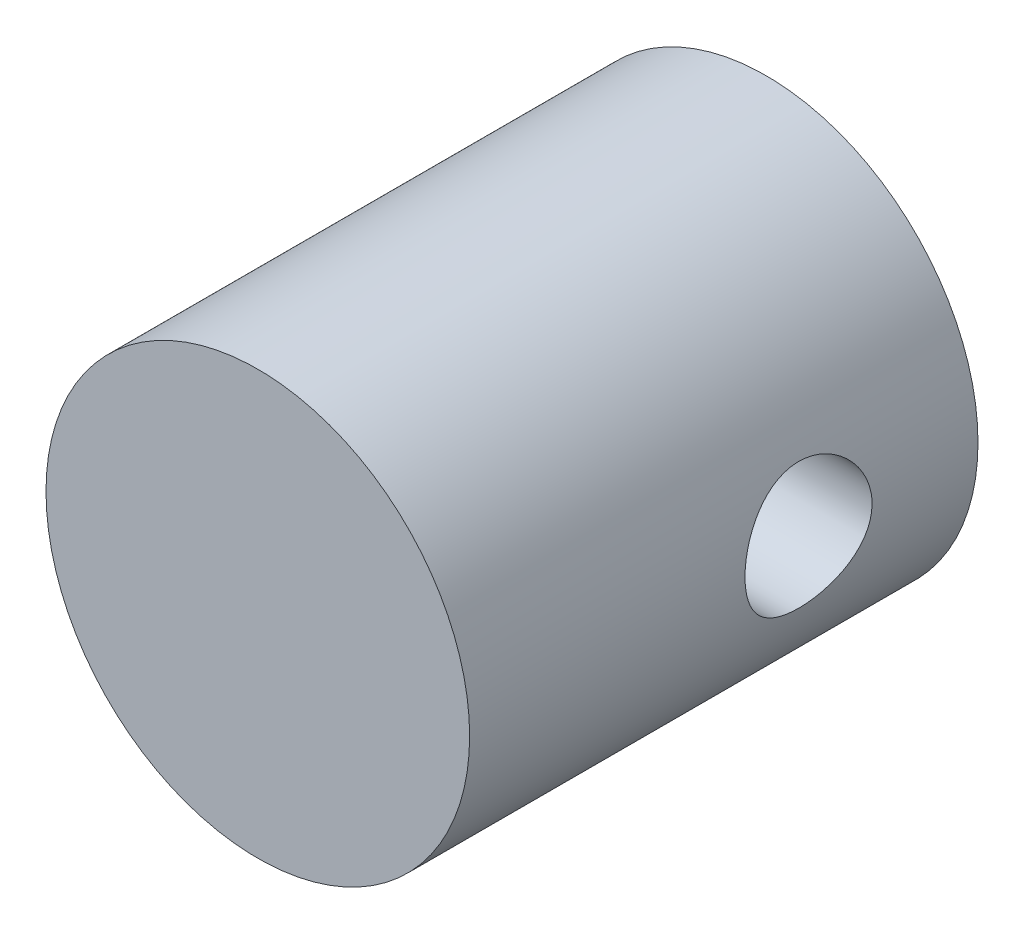
ISO-10303-21;
HEADER;
FILE_DESCRIPTION(('STEP AP214'),'2;1');
FILE_NAME('part.step','',(''),(''),'','','');
FILE_SCHEMA(('AUTOMOTIVE_DESIGN { 1 0 10303 214 1 1 1 1 }'));
ENDSEC;
DATA;
#1=APPLICATION_CONTEXT('core data for automotive mechanical design processes');
#2=APPLICATION_PROTOCOL_DEFINITION('international standard','automotive_design',2000,#1);
#3=PRODUCT_CONTEXT('',#1,'mechanical');
#4=PRODUCT('Part','Part','',(#3));
#5=PRODUCT_RELATED_PRODUCT_CATEGORY('part','',(#4));
#6=PRODUCT_DEFINITION_FORMATION('','',#4);
#7=PRODUCT_DEFINITION_CONTEXT('part definition',#1,'design');
#8=PRODUCT_DEFINITION('design','',#6,#7);
#9=PRODUCT_DEFINITION_SHAPE('','',#8);
#10=(LENGTH_UNIT() NAMED_UNIT(*) SI_UNIT(.MILLI.,.METRE.));
#11=(NAMED_UNIT(*) PLANE_ANGLE_UNIT() SI_UNIT($,.RADIAN.));
#12=(NAMED_UNIT(*) SI_UNIT($,.STERADIAN.) SOLID_ANGLE_UNIT());
#13=UNCERTAINTY_MEASURE_WITH_UNIT(LENGTH_MEASURE(1.E-05),#10,'distance_accuracy_value','');
#14=(GEOMETRIC_REPRESENTATION_CONTEXT(3) GLOBAL_UNCERTAINTY_ASSIGNED_CONTEXT((#13)) GLOBAL_UNIT_ASSIGNED_CONTEXT((#10,
#11,#12)) REPRESENTATION_CONTEXT('',''));
#15=CARTESIAN_POINT('',(0.,0.,0.));
#16=DIRECTION('',(0.,0.,1.));
#17=DIRECTION('',(1.,0.,0.));
#18=AXIS2_PLACEMENT_3D('',#15,#16,#17);
#19=CARTESIAN_POINT('',(0.,0.,6.));
#20=DIRECTION('',(0.,0.,-1.));
#21=DIRECTION('',(-1.,0.,0.));
#22=AXIS2_PLACEMENT_3D('',#19,#20,#21);
#23=CYLINDRICAL_SURFACE('',#22,2.5);
#24=CARTESIAN_POINT('',(-2.5,0.,1.25));
#25=CARTESIAN_POINT('',(-2.49999964625276,0.04114430637665,1.25000049874244));
#26=CARTESIAN_POINT('',(-2.49897457846979,0.0822936591757648,1.25339693181198));
#27=CARTESIAN_POINT('',(-2.49498552796844,0.16339406265244,1.26686067711105));
#28=CARTESIAN_POINT('',(-2.49202096694839,0.20334475220571,1.27692997901167));
#29=CARTESIAN_POINT('',(-2.48447776250925,0.280866353877264,1.30337300845513));
#30=CARTESIAN_POINT('',(-2.47990150125239,0.318440682197688,1.31973743480948));
#31=CARTESIAN_POINT('',(-2.46961054618796,0.390312090526564,1.35826804652791));
#32=CARTESIAN_POINT('',(-2.46389570095935,0.42460873373483,1.38043500369767));
#33=CARTESIAN_POINT('',(-2.45175368596488,0.489935898591878,1.43061200373637));
#34=CARTESIAN_POINT('',(-2.445311918289,0.52085903562219,1.4587583129431));
#35=CARTESIAN_POINT('',(-2.43252917104839,0.577624604616599,1.51980461495495));
#36=CARTESIAN_POINT('',(-2.42618820860824,0.603466181637131,1.55270540606195));
#37=CARTESIAN_POINT('',(-2.41417056998345,0.649900188618613,1.62323537651934));
#38=CARTESIAN_POINT('',(-2.4085120333744,0.67036154511135,1.6609542304974));
#39=CARTESIAN_POINT('',(-2.39871810191514,0.704606973873519,1.73949462711312));
#40=CARTESIAN_POINT('',(-2.39458234136111,0.71839264959881,1.78031542195642));
#41=CARTESIAN_POINT('',(-2.38845435439231,0.738508168412816,1.86269513306657));
#42=CARTESIAN_POINT('',(-2.38640534735889,0.745035981175235,1.90420137194677));
#43=CARTESIAN_POINT('',(-2.38451394948142,0.751068653075397,1.98776657812637));
#44=CARTESIAN_POINT('',(-2.38467102399599,0.750575213805359,2.02982540903726));
#45=CARTESIAN_POINT('',(-2.38712372015292,0.742734885998503,2.11169195430293));
#46=CARTESIAN_POINT('',(-2.38934194294585,0.735636026313277,2.15152612518077));
#47=CARTESIAN_POINT('',(-2.39554178119298,0.715187102135428,2.22940989313708));
#48=CARTESIAN_POINT('',(-2.3995235706752,0.701836420708245,2.26745931368726));
#49=CARTESIAN_POINT('',(-2.40886366536124,0.669080133268368,2.34130017483027));
#50=CARTESIAN_POINT('',(-2.4142400805761,0.649594084673201,2.37705354197761));
#51=CARTESIAN_POINT('',(-2.42575493500398,0.605176112943428,2.44486601100512));
#52=CARTESIAN_POINT('',(-2.43189355873596,0.580242870012945,2.4769242147069));
#53=CARTESIAN_POINT('',(-2.44455505648865,0.524406453827728,2.537843095381));
#54=CARTESIAN_POINT('',(-2.45108327155221,0.493297453733485,2.56651433201483));
#55=CARTESIAN_POINT('',(-2.46356122031657,0.426631629656984,2.61827699203213));
#56=CARTESIAN_POINT('',(-2.46951091759213,0.391074525930444,2.64136806420721));
#57=CARTESIAN_POINT('',(-2.48021580034728,0.316177519171401,2.68142996123237));
#58=CARTESIAN_POINT('',(-2.48496271834155,0.276813874873975,2.69835875812493));
#59=CARTESIAN_POINT('',(-2.49266760916113,0.19562270780176,2.72529979504982));
#60=CARTESIAN_POINT('',(-2.495626080935,0.153795875794791,2.73531396426625));
#61=CARTESIAN_POINT('',(-2.49934182321769,0.0704761213341656,2.7478260889497));
#62=CARTESIAN_POINT('',(-2.50017425208897,0.029025048800593,2.7505807929008));
#63=CARTESIAN_POINT('',(-2.49976461620879,-0.0537498029116912,2.74921542214396));
#64=CARTESIAN_POINT('',(-2.49852282838873,-0.095073598345389,2.74509626517428));
#65=CARTESIAN_POINT('',(-2.49415348493587,-0.17545180265485,2.73030769444425));
#66=CARTESIAN_POINT('',(-2.49106914899727,-0.214536386307091,2.71978830620955));
#67=CARTESIAN_POINT('',(-2.48337173920748,-0.290377319477256,2.69267838361091));
#68=CARTESIAN_POINT('',(-2.47875848160472,-0.327133388512772,2.67608711948112));
#69=CARTESIAN_POINT('',(-2.46834827175735,-0.398218594730548,2.63687341725938));
#70=CARTESIAN_POINT('',(-2.4625264041511,-0.432471913099915,2.6141203295258));
#71=CARTESIAN_POINT('',(-2.45036734381886,-0.496761653989995,2.5633876229738));
#72=CARTESIAN_POINT('',(-2.44403002214522,-0.526797016177672,2.53540669405695));
#73=CARTESIAN_POINT('',(-2.43126585935624,-0.582928722755441,2.47380634581452));
#74=CARTESIAN_POINT('',(-2.42484412520639,-0.608842406158679,2.44001906211106));
#75=CARTESIAN_POINT('',(-2.41288257615227,-0.654644975359607,2.36843603049631));
#76=CARTESIAN_POINT('',(-2.40734273812361,-0.674534019143021,2.33064038773239));
#77=CARTESIAN_POINT('',(-2.39783594822466,-0.707586735638617,2.25223375436488));
#78=CARTESIAN_POINT('',(-2.39386168977456,-0.720781734698862,2.21163690669671));
#79=CARTESIAN_POINT('',(-2.38795797236724,-0.740108654089556,2.12865601549723));
#80=CARTESIAN_POINT('',(-2.38602781268684,-0.746242994897492,2.08627258959433));
#81=CARTESIAN_POINT('',(-2.38449986234108,-0.751109922422096,2.00281924081899));
#82=CARTESIAN_POINT('',(-2.38480823717645,-0.750140276541593,1.96176817449311));
#83=CARTESIAN_POINT('',(-2.3874970064788,-0.741537527224924,1.8804429483117));
#84=CARTESIAN_POINT('',(-2.3898773179727,-0.733904690623809,1.84016875741132));
#85=CARTESIAN_POINT('',(-2.39637881834211,-0.712384444020455,1.76202730042907));
#86=CARTESIAN_POINT('',(-2.40047802272719,-0.698575877535282,1.72413635631929));
#87=CARTESIAN_POINT('',(-2.40995139454832,-0.665157535605707,1.651178780591));
#88=CARTESIAN_POINT('',(-2.41532580597228,-0.645546649814398,1.61611269117958));
#89=CARTESIAN_POINT('',(-2.42698838212842,-0.600243819025343,1.54841844173648));
#90=CARTESIAN_POINT('',(-2.43330270081879,-0.574356380464964,1.5159256193698));
#91=CARTESIAN_POINT('',(-2.44600660225033,-0.517587173148914,1.45564875084606));
#92=CARTESIAN_POINT('',(-2.45239620411958,-0.486704108567251,1.42786593026612));
#93=CARTESIAN_POINT('',(-2.46475468285319,-0.419732881091622,1.37698829385249));
#94=CARTESIAN_POINT('',(-2.47070579882836,-0.383518942895303,1.35405427657226));
#95=CARTESIAN_POINT('',(-2.48130340227908,-0.307570686991764,1.31463241504799));
#96=CARTESIAN_POINT('',(-2.48595049965534,-0.267838026499477,1.29814155586275));
#97=CARTESIAN_POINT('',(-2.4930108748465,-0.19037885632764,1.27355236217362));
#98=CARTESIAN_POINT('',(-2.49561013690534,-0.152893480977116,1.26474416355838));
#99=CARTESIAN_POINT('',(-2.49910472247246,-0.0769400976153893,1.25296823737921));
#100=CARTESIAN_POINT('',(-2.5000003307737,-0.0384722549290696,1.24999953364759));
#101=CARTESIAN_POINT('',(-2.5,0.,1.25));
#102=B_SPLINE_CURVE_WITH_KNOTS('',3,(#24,#25,#26,#27,#28,#29,#30,#31,#32,#33,#34,#35,#36,#37,
#38,#39,#40,#41,#42,#43,#44,#45,#46,#47,#48,#49,#50,#51,#52,#53,#54,#55,#56,#57,#58,#59,#60,#61,
#62,#63,#64,#65,#66,#67,#68,#69,#70,#71,#72,#73,#74,#75,#76,#77,#78,#79,#80,#81,#82,#83,#84,#85,
#86,#87,#88,#89,#90,#91,#92,#93,#94,#95,#96,#97,#98,#99,#100,#101),.UNSPECIFIED.,.T.,.F.,(4,2,2,
2,2,2,2,2,2,2,2,2,2,2,2,2,2,2,2,2,2,2,2,2,2,2,2,2,2,2,2,2,2,2,2,2,2,2,4),(0.,0.123291601806305,
0.246619982423,0.369766838150437,0.492930082206351,0.619278014740958,0.745647186443166,
0.874857405020546,1.00403657271612,1.12959844676438,1.25512989155768,1.37613008345061,
1.49714221825224,1.61981213219783,1.74251180075501,1.87033552020307,1.99816728261759,
2.12685523437067,2.25550726760627,2.37954404715496,2.50356426771387,2.62478373337387,
2.74601777293087,2.87005652847677,2.99412640996319,3.12270200157632,3.25127422122563,
3.37923907470651,3.50716004723841,3.62975077727171,3.75233659824499,3.8734002019506,
3.99448698770253,4.11998462833665,4.2455148744245,4.37471498072035,4.50385455791317,
4.61915845958929,4.73444308468136),.UNSPECIFIED.);
#103=CARTESIAN_POINT('',(-2.5,0.,1.25));
#104=VERTEX_POINT('',#103);
#105=EDGE_CURVE('E10',#104,#104,#102,.T.);
#106=ORIENTED_EDGE('',*,*,#105,.T.);
#107=EDGE_LOOP('',(#106));
#108=FACE_BOUND('',#107,.T.);
#109=CARTESIAN_POINT('',(2.5,0.,1.25));
#110=CARTESIAN_POINT('',(2.49999964625276,-0.04114430637665,1.25000049874244));
#111=CARTESIAN_POINT('',(2.49897457846979,-0.0822936591757648,1.25339693181198));
#112=CARTESIAN_POINT('',(2.49498552796844,-0.16339406265244,1.26686067711105));
#113=CARTESIAN_POINT('',(2.49202096694839,-0.20334475220571,1.27692997901167));
#114=CARTESIAN_POINT('',(2.48447776250925,-0.280866353877264,1.30337300845513));
#115=CARTESIAN_POINT('',(2.47990150125239,-0.318440682197688,1.31973743480948));
#116=CARTESIAN_POINT('',(2.46961054618796,-0.390312090526564,1.35826804652791));
#117=CARTESIAN_POINT('',(2.46389570095935,-0.42460873373483,1.38043500369767));
#118=CARTESIAN_POINT('',(2.45175368596488,-0.489935898591878,1.43061200373637));
#119=CARTESIAN_POINT('',(2.445311918289,-0.52085903562219,1.4587583129431));
#120=CARTESIAN_POINT('',(2.43252917104839,-0.577624604616599,1.51980461495495));
#121=CARTESIAN_POINT('',(2.42618820860824,-0.603466181637131,1.55270540606195));
#122=CARTESIAN_POINT('',(2.41417056998345,-0.649900188618613,1.62323537651934));
#123=CARTESIAN_POINT('',(2.4085120333744,-0.67036154511135,1.6609542304974));
#124=CARTESIAN_POINT('',(2.39871810191514,-0.704606973873519,1.73949462711312));
#125=CARTESIAN_POINT('',(2.39458234136111,-0.71839264959881,1.78031542195642));
#126=CARTESIAN_POINT('',(2.38845435439231,-0.738508168412816,1.86269513306657));
#127=CARTESIAN_POINT('',(2.38640534735889,-0.745035981175235,1.90420137194677));
#128=CARTESIAN_POINT('',(2.38451394948142,-0.751068653075397,1.98776657812637));
#129=CARTESIAN_POINT('',(2.38467102399599,-0.750575213805359,2.02982540903726));
#130=CARTESIAN_POINT('',(2.38712372015292,-0.742734885998503,2.11169195430293));
#131=CARTESIAN_POINT('',(2.38934194294585,-0.735636026313277,2.15152612518077));
#132=CARTESIAN_POINT('',(2.39554178119298,-0.715187102135428,2.22940989313708));
#133=CARTESIAN_POINT('',(2.3995235706752,-0.701836420708245,2.26745931368726));
#134=CARTESIAN_POINT('',(2.40886366536124,-0.669080133268368,2.34130017483027));
#135=CARTESIAN_POINT('',(2.4142400805761,-0.649594084673201,2.37705354197761));
#136=CARTESIAN_POINT('',(2.42575493500398,-0.605176112943428,2.44486601100512));
#137=CARTESIAN_POINT('',(2.43189355873596,-0.580242870012945,2.4769242147069));
#138=CARTESIAN_POINT('',(2.44455505648865,-0.524406453827728,2.537843095381));
#139=CARTESIAN_POINT('',(2.45108327155221,-0.493297453733485,2.56651433201483));
#140=CARTESIAN_POINT('',(2.46356122031657,-0.426631629656984,2.61827699203213));
#141=CARTESIAN_POINT('',(2.46951091759213,-0.391074525930444,2.64136806420721));
#142=CARTESIAN_POINT('',(2.48021580034728,-0.316177519171401,2.68142996123237));
#143=CARTESIAN_POINT('',(2.48496271834155,-0.276813874873975,2.69835875812493));
#144=CARTESIAN_POINT('',(2.49266760916113,-0.19562270780176,2.72529979504982));
#145=CARTESIAN_POINT('',(2.495626080935,-0.153795875794791,2.73531396426625));
#146=CARTESIAN_POINT('',(2.49934182321769,-0.0704761213341656,2.7478260889497));
#147=CARTESIAN_POINT('',(2.50017425208897,-0.029025048800593,2.7505807929008));
#148=CARTESIAN_POINT('',(2.49976461620879,0.0537498029116912,2.74921542214396));
#149=CARTESIAN_POINT('',(2.49852282838873,0.095073598345389,2.74509626517428));
#150=CARTESIAN_POINT('',(2.49415348493587,0.17545180265485,2.73030769444425));
#151=CARTESIAN_POINT('',(2.49106914899727,0.214536386307091,2.71978830620955));
#152=CARTESIAN_POINT('',(2.48337173920748,0.290377319477256,2.69267838361091));
#153=CARTESIAN_POINT('',(2.47875848160472,0.327133388512772,2.67608711948112));
#154=CARTESIAN_POINT('',(2.46834827175735,0.398218594730548,2.63687341725938));
#155=CARTESIAN_POINT('',(2.4625264041511,0.432471913099915,2.6141203295258));
#156=CARTESIAN_POINT('',(2.45036734381886,0.496761653989995,2.5633876229738));
#157=CARTESIAN_POINT('',(2.44403002214522,0.526797016177672,2.53540669405695));
#158=CARTESIAN_POINT('',(2.43126585935624,0.582928722755441,2.47380634581452));
#159=CARTESIAN_POINT('',(2.42484412520639,0.608842406158679,2.44001906211106));
#160=CARTESIAN_POINT('',(2.41288257615227,0.654644975359607,2.36843603049631));
#161=CARTESIAN_POINT('',(2.40734273812361,0.674534019143021,2.33064038773239));
#162=CARTESIAN_POINT('',(2.39783594822466,0.707586735638617,2.25223375436488));
#163=CARTESIAN_POINT('',(2.39386168977456,0.720781734698862,2.21163690669671));
#164=CARTESIAN_POINT('',(2.38795797236724,0.740108654089556,2.12865601549723));
#165=CARTESIAN_POINT('',(2.38602781268684,0.746242994897492,2.08627258959433));
#166=CARTESIAN_POINT('',(2.38449986234108,0.751109922422096,2.00281924081899));
#167=CARTESIAN_POINT('',(2.38480823717645,0.750140276541593,1.96176817449311));
#168=CARTESIAN_POINT('',(2.3874970064788,0.741537527224924,1.8804429483117));
#169=CARTESIAN_POINT('',(2.3898773179727,0.733904690623809,1.84016875741132));
#170=CARTESIAN_POINT('',(2.39637881834211,0.712384444020455,1.76202730042907));
#171=CARTESIAN_POINT('',(2.40047802272719,0.698575877535282,1.72413635631929));
#172=CARTESIAN_POINT('',(2.40995139454832,0.665157535605707,1.651178780591));
#173=CARTESIAN_POINT('',(2.41532580597228,0.645546649814398,1.61611269117958));
#174=CARTESIAN_POINT('',(2.42698838212842,0.600243819025343,1.54841844173648));
#175=CARTESIAN_POINT('',(2.43330270081879,0.574356380464964,1.5159256193698));
#176=CARTESIAN_POINT('',(2.44600660225033,0.517587173148914,1.45564875084606));
#177=CARTESIAN_POINT('',(2.45239620411958,0.486704108567251,1.42786593026612));
#178=CARTESIAN_POINT('',(2.46475468285319,0.419732881091622,1.37698829385249));
#179=CARTESIAN_POINT('',(2.47070579882836,0.383518942895303,1.35405427657226));
#180=CARTESIAN_POINT('',(2.48130340227908,0.307570686991764,1.31463241504799));
#181=CARTESIAN_POINT('',(2.48595049965534,0.267838026499477,1.29814155586275));
#182=CARTESIAN_POINT('',(2.4930108748465,0.19037885632764,1.27355236217362));
#183=CARTESIAN_POINT('',(2.49561013690534,0.152893480977116,1.26474416355838));
#184=CARTESIAN_POINT('',(2.49910472247246,0.0769400976153893,1.25296823737921));
#185=CARTESIAN_POINT('',(2.5000003307737,0.0384722549290696,1.24999953364759));
#186=CARTESIAN_POINT('',(2.5,0.,1.25));
#187=B_SPLINE_CURVE_WITH_KNOTS('',3,(#109,#110,#111,#112,#113,#114,#115,#116,#117,#118,#119,
#120,#121,#122,#123,#124,#125,#126,#127,#128,#129,#130,#131,#132,#133,#134,#135,#136,#137,#138,
#139,#140,#141,#142,#143,#144,#145,#146,#147,#148,#149,#150,#151,#152,#153,#154,#155,#156,#157,
#158,#159,#160,#161,#162,#163,#164,#165,#166,#167,#168,#169,#170,#171,#172,#173,#174,#175,#176,
#177,#178,#179,#180,#181,#182,#183,#184,#185,#186),.UNSPECIFIED.,.T.,.F.,(4,2,2,2,2,2,2,2,2,2,2,
2,2,2,2,2,2,2,2,2,2,2,2,2,2,2,2,2,2,2,2,2,2,2,2,2,2,2,4),(0.,0.123291601806305,0.246619982423,
0.369766838150437,0.492930082206351,0.619278014740958,0.745647186443166,0.874857405020546,
1.00403657271612,1.12959844676438,1.25512989155768,1.37613008345061,1.49714221825224,
1.61981213219783,1.74251180075501,1.87033552020307,1.99816728261759,2.12685523437067,
2.25550726760627,2.37954404715496,2.50356426771387,2.62478373337387,2.74601777293087,
2.87005652847677,2.99412640996319,3.12270200157632,3.25127422122563,3.37923907470651,
3.50716004723841,3.62975077727171,3.75233659824499,3.8734002019506,3.99448698770253,
4.11998462833665,4.2455148744245,4.37471498072035,4.50385455791317,4.61915845958929,
4.73444308468136),.UNSPECIFIED.);
#188=CARTESIAN_POINT('',(2.5,0.,1.25));
#189=VERTEX_POINT('',#188);
#190=EDGE_CURVE('E49',#189,#189,#187,.T.);
#191=ORIENTED_EDGE('',*,*,#190,.T.);
#192=EDGE_LOOP('',(#191));
#193=FACE_BOUND('',#192,.T.);
#194=CARTESIAN_POINT('',(0.,0.,6.));
#195=DIRECTION('',(0.,0.,1.));
#196=DIRECTION('',(1.,0.,0.));
#197=AXIS2_PLACEMENT_3D('',#194,#195,#196);
#198=CIRCLE('',#197,2.5);
#199=CARTESIAN_POINT('',(2.5,0.,6.));
#200=VERTEX_POINT('',#199);
#201=EDGE_CURVE('E54',#200,#200,#198,.T.);
#202=ORIENTED_EDGE('',*,*,#201,.F.);
#203=EDGE_LOOP('',(#202));
#204=FACE_BOUND('',#203,.T.);
#205=CARTESIAN_POINT('',(0.,0.,0.));
#206=DIRECTION('',(0.,0.,1.));
#207=DIRECTION('',(1.,0.,0.));
#208=AXIS2_PLACEMENT_3D('',#205,#206,#207);
#209=CIRCLE('',#208,2.5);
#210=CARTESIAN_POINT('',(2.5,0.,0.));
#211=VERTEX_POINT('',#210);
#212=EDGE_CURVE('E59',#211,#211,#209,.T.);
#213=ORIENTED_EDGE('',*,*,#212,.T.);
#214=EDGE_LOOP('',(#213));
#215=FACE_BOUND('',#214,.T.);
#216=ADVANCED_FACE('F37',(#108,#193,#204,#215),#23,.T.);
#217=CARTESIAN_POINT('',(0.,0.,6.));
#218=DIRECTION('',(0.,0.,1.));
#219=DIRECTION('',(1.,0.,0.));
#220=AXIS2_PLACEMENT_3D('',#217,#218,#219);
#221=PLANE('',#220);
#222=ORIENTED_EDGE('',*,*,#201,.T.);
#223=EDGE_LOOP('',(#222));
#224=FACE_BOUND('',#223,.T.);
#225=ADVANCED_FACE('F71',(#224),#221,.T.);
#226=CARTESIAN_POINT('',(0.,0.,0.));
#227=DIRECTION('',(0.,0.,1.));
#228=DIRECTION('',(1.,0.,0.));
#229=AXIS2_PLACEMENT_3D('',#226,#227,#228);
#230=PLANE('',#229);
#231=ORIENTED_EDGE('',*,*,#212,.F.);
#232=EDGE_LOOP('',(#231));
#233=FACE_BOUND('',#232,.T.);
#234=ADVANCED_FACE('F69',(#233),#230,.F.);
#235=CARTESIAN_POINT('',(-2.5,0.,2.));
#236=DIRECTION('',(1.,0.,0.));
#237=DIRECTION('',(0.,0.,-1.));
#238=AXIS2_PLACEMENT_3D('',#235,#236,#237);
#239=CYLINDRICAL_SURFACE('',#238,0.75);
#240=ORIENTED_EDGE('',*,*,#190,.F.);
#241=EDGE_LOOP('',(#240));
#242=FACE_BOUND('',#241,.T.);
#243=ORIENTED_EDGE('',*,*,#105,.F.);
#244=EDGE_LOOP('',(#243));
#245=FACE_BOUND('',#244,.T.);
#246=ADVANCED_FACE('F65',(#242,#245),#239,.F.);
#247=CLOSED_SHELL('',(#216,#225,#234,#246));
#248=MANIFOLD_SOLID_BREP('B2',#247);
#249=ADVANCED_BREP_SHAPE_REPRESENTATION('',(#18,#248),#14);
#250=SHAPE_DEFINITION_REPRESENTATION(#9,#249);
ENDSEC;
END-ISO-10303-21;
